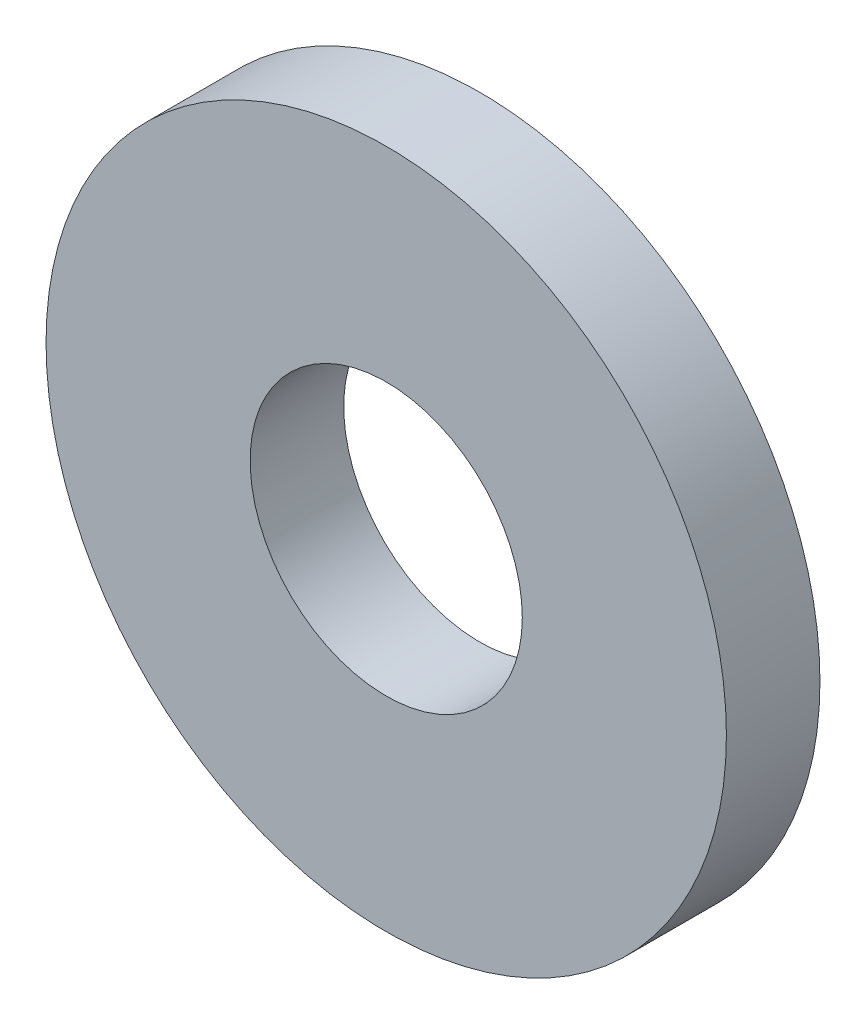
ISO-10303-21;
HEADER;
FILE_DESCRIPTION(('STEP AP214'),'2;1');
FILE_NAME('part.step','',(''),(''),'','','');
FILE_SCHEMA(('AUTOMOTIVE_DESIGN { 1 0 10303 214 1 1 1 1 }'));
ENDSEC;
DATA;
#1=APPLICATION_CONTEXT('core data for automotive mechanical design processes');
#2=APPLICATION_PROTOCOL_DEFINITION('international standard','automotive_design',2000,#1);
#3=PRODUCT_CONTEXT('',#1,'mechanical');
#4=PRODUCT('Part','Part','',(#3));
#5=PRODUCT_RELATED_PRODUCT_CATEGORY('part','',(#4));
#6=PRODUCT_DEFINITION_FORMATION('','',#4);
#7=PRODUCT_DEFINITION_CONTEXT('part definition',#1,'design');
#8=PRODUCT_DEFINITION('design','',#6,#7);
#9=PRODUCT_DEFINITION_SHAPE('','',#8);
#10=(LENGTH_UNIT() NAMED_UNIT(*) SI_UNIT(.MILLI.,.METRE.));
#11=(NAMED_UNIT(*) PLANE_ANGLE_UNIT() SI_UNIT($,.RADIAN.));
#12=(NAMED_UNIT(*) SI_UNIT($,.STERADIAN.) SOLID_ANGLE_UNIT());
#13=UNCERTAINTY_MEASURE_WITH_UNIT(LENGTH_MEASURE(1.E-05),#10,'distance_accuracy_value','');
#14=(GEOMETRIC_REPRESENTATION_CONTEXT(3) GLOBAL_UNCERTAINTY_ASSIGNED_CONTEXT((#13)) GLOBAL_UNIT_ASSIGNED_CONTEXT((#10,
#11,#12)) REPRESENTATION_CONTEXT('',''));
#15=CARTESIAN_POINT('',(0.,0.,0.));
#16=DIRECTION('',(0.,0.,1.));
#17=DIRECTION('',(1.,0.,0.));
#18=AXIS2_PLACEMENT_3D('',#15,#16,#17);
#19=CARTESIAN_POINT('',(0.,0.,1.1));
#20=DIRECTION('',(0.,0.,1.));
#21=DIRECTION('',(1.,0.,0.));
#22=AXIS2_PLACEMENT_3D('',#19,#20,#21);
#23=PLANE('',#22);
#24=CARTESIAN_POINT('',(0.,0.,1.1));
#25=DIRECTION('',(0.,0.,1.));
#26=DIRECTION('',(1.,0.,0.));
#27=AXIS2_PLACEMENT_3D('',#24,#25,#26);
#28=CIRCLE('',#27,4.);
#29=CARTESIAN_POINT('',(4.,0.,1.1));
#30=VERTEX_POINT('',#29);
#31=EDGE_CURVE('E10',#30,#30,#28,.T.);
#32=ORIENTED_EDGE('',*,*,#31,.T.);
#33=EDGE_LOOP('',(#32));
#34=FACE_BOUND('',#33,.T.);
#35=CARTESIAN_POINT('',(0.,0.,1.1));
#36=DIRECTION('',(0.,0.,1.));
#37=DIRECTION('',(1.,0.,0.));
#38=AXIS2_PLACEMENT_3D('',#35,#36,#37);
#39=CIRCLE('',#38,1.6);
#40=CARTESIAN_POINT('',(1.6,0.,1.1));
#41=VERTEX_POINT('',#40);
#42=EDGE_CURVE('E41',#41,#41,#39,.T.);
#43=ORIENTED_EDGE('',*,*,#42,.F.);
#44=EDGE_LOOP('',(#43));
#45=FACE_BOUND('',#44,.T.);
#46=ADVANCED_FACE('F30',(#34,#45),#23,.T.);
#47=CARTESIAN_POINT('',(0.,0.,0.));
#48=DIRECTION('',(0.,0.,1.));
#49=DIRECTION('',(1.,0.,0.));
#50=AXIS2_PLACEMENT_3D('',#47,#48,#49);
#51=PLANE('',#50);
#52=CARTESIAN_POINT('',(0.,0.,0.));
#53=DIRECTION('',(0.,0.,1.));
#54=DIRECTION('',(1.,0.,0.));
#55=AXIS2_PLACEMENT_3D('',#52,#53,#54);
#56=CIRCLE('',#55,4.);
#57=CARTESIAN_POINT('',(4.,0.,0.));
#58=VERTEX_POINT('',#57);
#59=EDGE_CURVE('E34',#58,#58,#56,.T.);
#60=ORIENTED_EDGE('',*,*,#59,.F.);
#61=EDGE_LOOP('',(#60));
#62=FACE_BOUND('',#61,.T.);
#63=CARTESIAN_POINT('',(0.,0.,0.));
#64=DIRECTION('',(0.,0.,1.));
#65=DIRECTION('',(1.,0.,0.));
#66=AXIS2_PLACEMENT_3D('',#63,#64,#65);
#67=CIRCLE('',#66,1.6);
#68=CARTESIAN_POINT('',(1.6,0.,0.));
#69=VERTEX_POINT('',#68);
#70=EDGE_CURVE('E43',#69,#69,#67,.T.);
#71=ORIENTED_EDGE('',*,*,#70,.T.);
#72=EDGE_LOOP('',(#71));
#73=FACE_BOUND('',#72,.T.);
#74=ADVANCED_FACE('F53',(#62,#73),#51,.F.);
#75=CARTESIAN_POINT('',(0.,0.,1.1));
#76=DIRECTION('',(0.,0.,-1.));
#77=DIRECTION('',(-1.,0.,0.));
#78=AXIS2_PLACEMENT_3D('',#75,#76,#77);
#79=CYLINDRICAL_SURFACE('',#78,4.);
#80=ORIENTED_EDGE('',*,*,#31,.F.);
#81=EDGE_LOOP('',(#80));
#82=FACE_BOUND('',#81,.T.);
#83=ORIENTED_EDGE('',*,*,#59,.T.);
#84=EDGE_LOOP('',(#83));
#85=FACE_BOUND('',#84,.T.);
#86=ADVANCED_FACE('F32',(#82,#85),#79,.T.);
#87=CARTESIAN_POINT('',(0.,0.,1.1));
#88=DIRECTION('',(0.,0.,-1.));
#89=DIRECTION('',(-1.,0.,0.));
#90=AXIS2_PLACEMENT_3D('',#87,#88,#89);
#91=CYLINDRICAL_SURFACE('',#90,1.6);
#92=ORIENTED_EDGE('',*,*,#42,.T.);
#93=EDGE_LOOP('',(#92));
#94=FACE_BOUND('',#93,.T.);
#95=ORIENTED_EDGE('',*,*,#70,.F.);
#96=EDGE_LOOP('',(#95));
#97=FACE_BOUND('',#96,.T.);
#98=ADVANCED_FACE('F49',(#94,#97),#91,.F.);
#99=CLOSED_SHELL('',(#46,#74,#86,#98));
#100=MANIFOLD_SOLID_BREP('B2',#99);
#101=ADVANCED_BREP_SHAPE_REPRESENTATION('',(#18,#100),#14);
#102=SHAPE_DEFINITION_REPRESENTATION(#9,#101);
ENDSEC;
END-ISO-10303-21;
